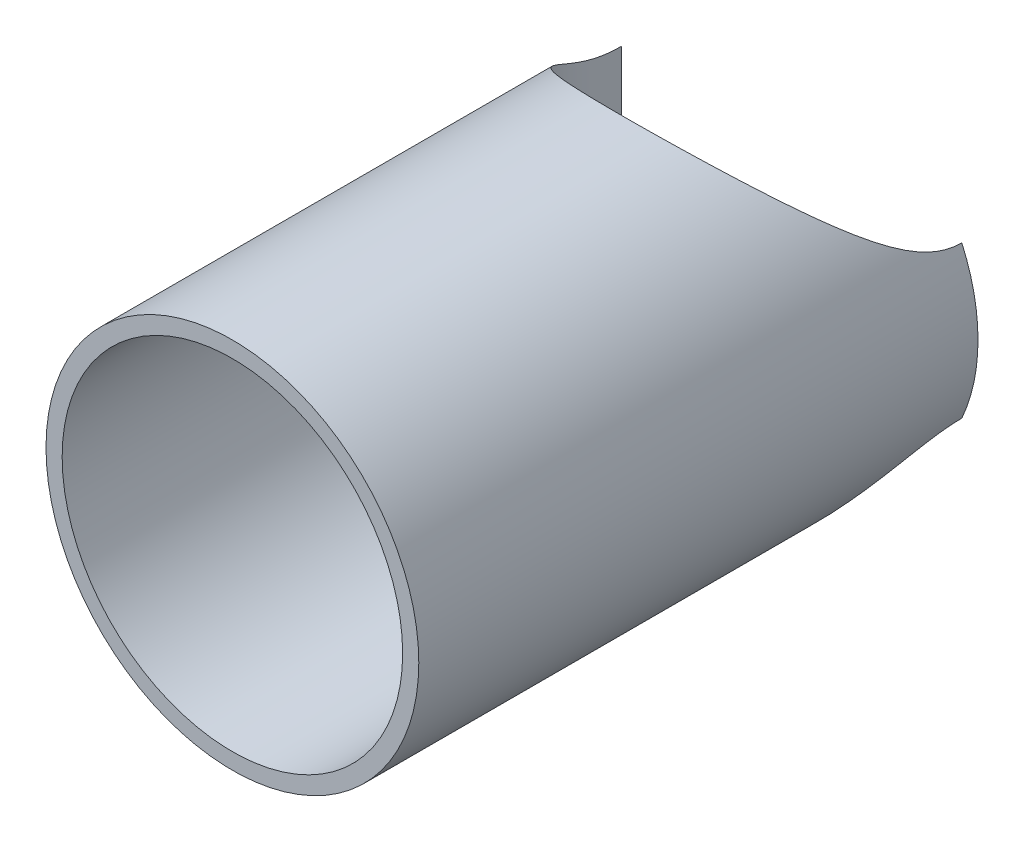
ISO-10303-21;
HEADER;
FILE_DESCRIPTION(('STEP AP214'),'2;1');
FILE_NAME('part.step','',(''),(''),'','','');
FILE_SCHEMA(('AUTOMOTIVE_DESIGN { 1 0 10303 214 1 1 1 1 }'));
ENDSEC;
DATA;
#1=APPLICATION_CONTEXT('core data for automotive mechanical design processes');
#2=APPLICATION_PROTOCOL_DEFINITION('international standard','automotive_design',2000,#1);
#3=PRODUCT_CONTEXT('',#1,'mechanical');
#4=PRODUCT('Part','Part','',(#3));
#5=PRODUCT_RELATED_PRODUCT_CATEGORY('part','',(#4));
#6=PRODUCT_DEFINITION_FORMATION('','',#4);
#7=PRODUCT_DEFINITION_CONTEXT('part definition',#1,'design');
#8=PRODUCT_DEFINITION('design','',#6,#7);
#9=PRODUCT_DEFINITION_SHAPE('','',#8);
#10=(LENGTH_UNIT() NAMED_UNIT(*) SI_UNIT(.MILLI.,.METRE.));
#11=(NAMED_UNIT(*) PLANE_ANGLE_UNIT() SI_UNIT($,.RADIAN.));
#12=(NAMED_UNIT(*) SI_UNIT($,.STERADIAN.) SOLID_ANGLE_UNIT());
#13=UNCERTAINTY_MEASURE_WITH_UNIT(LENGTH_MEASURE(1.E-05),#10,'distance_accuracy_value','');
#14=(GEOMETRIC_REPRESENTATION_CONTEXT(3) GLOBAL_UNCERTAINTY_ASSIGNED_CONTEXT((#13)) GLOBAL_UNIT_ASSIGNED_CONTEXT((#10,
#11,#12)) REPRESENTATION_CONTEXT('',''));
#15=CARTESIAN_POINT('',(0.,0.,0.));
#16=DIRECTION('',(0.,0.,1.));
#17=DIRECTION('',(1.,0.,0.));
#18=AXIS2_PLACEMENT_3D('',#15,#16,#17);
#19=CARTESIAN_POINT('',(0.,0.,0.));
#20=DIRECTION('',(0.,0.,1.));
#21=DIRECTION('',(1.,0.,0.));
#22=AXIS2_PLACEMENT_3D('',#19,#20,#21);
#23=CYLINDRICAL_SURFACE('',#22,17.399);
#24=CARTESIAN_POINT('',(0.,0.,57.15));
#25=DIRECTION('',(0.,0.,1.));
#26=DIRECTION('',(1.,0.,0.));
#27=AXIS2_PLACEMENT_3D('',#24,#25,#26);
#28=CIRCLE('',#27,17.399);
#29=CARTESIAN_POINT('',(17.399,0.,57.15));
#30=VERTEX_POINT('',#29);
#31=EDGE_CURVE('E63',#30,#30,#28,.T.);
#32=ORIENTED_EDGE('',*,*,#31,.T.);
#33=EDGE_LOOP('',(#32));
#34=FACE_BOUND('',#33,.T.);
#35=CARTESIAN_POINT('',(0.,0.,0.));
#36=DIRECTION('',(0.,0.707106781186547,0.707106781186547));
#37=DIRECTION('',(0.,-0.707106781186547,0.707106781186547));
#38=AXIS2_PLACEMENT_3D('',#35,#36,#37);
#39=ELLIPSE('',#38,24.6059017717295,17.399);
#40=CARTESIAN_POINT('',(17.399,0.,0.));
#41=VERTEX_POINT('',#40);
#42=CARTESIAN_POINT('',(-17.399,0.,0.));
#43=VERTEX_POINT('',#42);
#44=EDGE_CURVE('E66',#41,#43,#39,.F.);
#45=ORIENTED_EDGE('',*,*,#44,.T.);
#46=CARTESIAN_POINT('',(-17.399,0.,0.));
#47=CARTESIAN_POINT('',(-17.3990011308637,0.331328994913658,0.331288499369272));
#48=CARTESIAN_POINT('',(-17.3895359806133,0.662777773993524,0.662452537391861));
#49=CARTESIAN_POINT('',(-17.3541828902262,1.28061881246956,1.27984220901783));
#50=CARTESIAN_POINT('',(-17.3306707170862,1.56708522254114,1.56613126731348));
#51=CARTESIAN_POINT('',(-17.2741593932983,2.09467960281504,2.09380128423432));
#52=CARTESIAN_POINT('',(-17.2431973119173,2.33594824844743,2.33526043823023));
#53=CARTESIAN_POINT('',(-17.1776790099059,2.77346193365283,2.77318291899473));
#54=CARTESIAN_POINT('',(-17.1448260231368,2.96984141024758,2.96976916303656));
#55=CARTESIAN_POINT('',(-17.053195396441,3.46498957987095,3.46509972389225));
#56=CARTESIAN_POINT('',(-16.98985851291,3.76343285860517,3.76334049026127));
#57=CARTESIAN_POINT('',(-16.8511806994521,4.34120611378342,4.34086899698307));
#58=CARTESIAN_POINT('',(-16.7767389829828,4.62064871339775,4.62026081720835));
#59=CARTESIAN_POINT('',(-16.618357658026,5.16038592403,5.16002415026488));
#60=CARTESIAN_POINT('',(-16.5352733410015,5.42080962241243,5.42051715790507));
#61=CARTESIAN_POINT('',(-16.3619682824427,5.9225854699662,5.92246621840775));
#62=CARTESIAN_POINT('',(-16.2725596410971,6.16407928160144,6.16406139907093));
#63=CARTESIAN_POINT('',(-16.0648641936773,6.68870400423923,6.68872514664784));
#64=CARTESIAN_POINT('',(-15.9442842191765,6.97140000285117,6.97132558864669));
#65=CARTESIAN_POINT('',(-15.692090264551,7.52138357655295,7.52117234296158));
#66=CARTESIAN_POINT('',(-15.5611400425067,7.7888244237628,7.78856984279287));
#67=CARTESIAN_POINT('',(-15.2898825899193,8.30823658158246,8.30799045094507));
#68=CARTESIAN_POINT('',(-15.1502208515848,8.56037821331848,8.56017986480889));
#69=CARTESIAN_POINT('',(-14.8631475667476,9.04924098266211,9.04916207079481));
#70=CARTESIAN_POINT('',(-14.716363574788,9.28614688008941,9.28613845727461));
#71=CARTESIAN_POINT('',(-14.3951906833458,9.77740171343267,9.77741091638758));
#72=CARTESIAN_POINT('',(-14.2195041976432,10.0313338750929,10.0312781848761));
#73=CARTESIAN_POINT('',(-13.8583245878214,10.524357664459,10.5242054716175));
#74=CARTESIAN_POINT('',(-13.6733966582859,10.7636567269108,10.7634718304358));
#75=CARTESIAN_POINT('',(-13.2950314709039,11.2273598541476,11.2271796122021));
#76=CARTESIAN_POINT('',(-13.1021449124595,11.4519894946947,11.4518441165275));
#77=CARTESIAN_POINT('',(-12.7091177143155,11.8863833716026,11.8863260772742));
#78=CARTESIAN_POINT('',(-12.5095124093792,12.0963898718007,12.0963850678313));
#79=CARTESIAN_POINT('',(-12.0888476825434,12.5170535611354,12.5170585405004));
#80=CARTESIAN_POINT('',(-11.867271036784,12.7274545640097,12.7274132906681));
#81=CARTESIAN_POINT('',(-11.4161369932612,13.1334001596869,13.1332890696922));
#82=CARTESIAN_POINT('',(-11.1870452916996,13.3292035388693,13.3290682211509));
#83=CARTESIAN_POINT('',(-10.7219396261346,13.7059083660326,13.7057759704559));
#84=CARTESIAN_POINT('',(-10.4863707163118,13.8870849012415,13.8869780619076));
#85=CARTESIAN_POINT('',(-10.0093409437893,14.2345561896179,14.2345143840518));
#86=CARTESIAN_POINT('',(-9.76830223262916,14.4011404127409,14.4011376187175));
#87=CARTESIAN_POINT('',(-9.27469282491392,14.7238513521684,14.7238541327518));
#88=CARTESIAN_POINT('',(-9.02218317762893,14.8800245173527,14.8799942085943));
#89=CARTESIAN_POINT('',(-8.51143320550011,15.17780577695,15.1777255632559));
#90=CARTESIAN_POINT('',(-8.25351231100356,15.3196868999698,15.3195894701364));
#91=CARTESIAN_POINT('',(-7.86055793692457,15.522822723787,15.5227259132659));
#92=CARTESIAN_POINT('',(-7.72987393547371,15.5883224924115,15.5882301268393));
#93=CARTESIAN_POINT('',(-7.46744079934224,15.7157097134347,15.7156329083403));
#94=CARTESIAN_POINT('',(-7.33572578439618,15.7776322605029,15.7775664862578));
#95=CARTESIAN_POINT('',(-7.0713408526649,15.89786675948,15.8978253102093));
#96=CARTESIAN_POINT('',(-6.93870294731716,15.9562139212813,15.9561857364243));
#97=CARTESIAN_POINT('',(-6.67257484172981,16.0693059665347,16.0692983003262));
#98=CARTESIAN_POINT('',(-6.5391145696896,16.124086000282,16.1240856593634));
#99=CARTESIAN_POINT('',(-6.27314212663758,16.2293820508048,16.2293823833748));
#100=CARTESIAN_POINT('',(-6.14068677200883,16.2799696359967,16.2799636546496));
#101=CARTESIAN_POINT('',(-5.8748684496391,16.3777589819801,16.3777371159858));
#102=CARTESIAN_POINT('',(-5.74152553126073,16.4249879659121,16.4249565601746));
#103=CARTESIAN_POINT('',(-5.47402115877983,16.5160550971116,16.5160062636609));
#104=CARTESIAN_POINT('',(-5.33987788890363,16.5599199494832,16.5598632139616));
#105=CARTESIAN_POINT('',(-5.0708615482511,16.6442561413558,16.6441886913204));
#106=CARTESIAN_POINT('',(-4.93600480608221,16.6847535344294,16.6846832285512));
#107=CARTESIAN_POINT('',(-4.66564969995905,16.7623545036231,16.762284561608));
#108=CARTESIAN_POINT('',(-4.53016583341798,16.7994833464645,16.7994165741733));
#109=CARTESIAN_POINT('',(-4.25864402464156,16.8703492415508,16.8702936771996));
#110=CARTESIAN_POINT('',(-4.1226187875179,16.9041106384636,16.9040630739031));
#111=CARTESIAN_POINT('',(-3.85010126264908,16.9682459387044,16.9682159832133));
#112=CARTESIAN_POINT('',(-3.7136199403314,16.9986431310521,16.9986227724491));
#113=CARTESIAN_POINT('',(-3.44027598403682,17.0560566629996,17.0560512035975));
#114=CARTESIAN_POINT('',(-3.30342264906392,17.0830951044979,17.0830949768953));
#115=CARTESIAN_POINT('',(-3.03546364409865,17.1326815825355,17.132681703699));
#116=CARTESIAN_POINT('',(-2.90441642762355,17.1553873643714,17.1553829144864));
#117=CARTESIAN_POINT('',(-2.64192370290757,17.1977626436417,17.1977466393632));
#118=CARTESIAN_POINT('',(-2.51048219796085,17.2174445285761,17.2174215511955));
#119=CARTESIAN_POINT('',(-2.24727207444598,17.2537692378582,17.2537335254227));
#120=CARTESIAN_POINT('',(-2.11550651579715,17.2704231484942,17.2703816696755));
#121=CARTESIAN_POINT('',(-1.85171901959868,17.3006908882117,17.3006415630633));
#122=CARTESIAN_POINT('',(-1.71969931056298,17.3143144308917,17.3142630138654));
#123=CARTESIAN_POINT('',(-1.45547409463277,17.3385220761164,17.3384708920411));
#124=CARTESIAN_POINT('',(-1.323270104293,17.3491144575098,17.3490655860987));
#125=CARTESIAN_POINT('',(-1.05874661674972,17.3672620877226,17.36722140925));
#126=CARTESIAN_POINT('',(-0.926428051590948,17.3748241285407,17.3747893222893));
#127=CARTESIAN_POINT('',(-0.661745401360201,17.3869150272733,17.3868930938386));
#128=CARTESIAN_POINT('',(-0.529381797623768,17.3914491490759,17.3914342142522));
#129=CARTESIAN_POINT('',(-0.264678682179303,17.3974897824417,17.3974858865217));
#130=CARTESIAN_POINT('',(-0.13233933998178,17.3989999999915,17.3990001479815));
#131=CARTESIAN_POINT('',(0.132343102844987,17.3990000000085,17.3989998520142));
#132=CARTESIAN_POINT('',(0.264686203474104,17.3974896965932,17.3974852084662));
#133=CARTESIAN_POINT('',(0.529395756251864,17.3914487446318,17.3914329206721));
#134=CARTESIAN_POINT('',(0.661762040001853,17.3869144144388,17.3868915915467));
#135=CARTESIAN_POINT('',(0.92644896772938,17.3748230255675,17.3747874520819));
#136=CARTESIAN_POINT('',(1.0587691326032,17.3672607273787,17.3672194044208));
#137=CARTESIAN_POINT('',(1.32329473756529,17.3491125827395,17.3490633877189));
#138=CARTESIAN_POINT('',(1.4554992489517,17.3385199686424,17.3384686592246));
#139=CARTESIAN_POINT('',(1.71972442920772,17.3143119319016,17.3142607827641));
#140=CARTESIAN_POINT('',(1.85174358595603,17.3006882546736,17.300639392332));
#141=CARTESIAN_POINT('',(2.11552890590344,17.2704203934741,17.270379685527));
#142=CARTESIAN_POINT('',(2.24729284607558,17.2537665200233,17.2537316913085));
#143=CARTESIAN_POINT('',(2.51049867631982,17.2174421050912,17.2174201090593));
#144=CARTESIAN_POINT('',(2.64193751299076,17.1977605012373,17.1977454625961));
#145=CARTESIAN_POINT('',(2.90442384157753,17.1553860801165,17.1553822628499));
#146=CARTESIAN_POINT('',(3.03546733761075,17.1326808990283,17.1326813342488));
#147=CARTESIAN_POINT('',(3.30342657291425,17.0830943783941,17.0830939200179));
#148=CARTESIAN_POINT('',(3.44028379405071,17.0560551202761,17.0560490037316));
#149=CARTESIAN_POINT('',(3.71363437804045,16.9986400001387,16.9986186527062));
#150=CARTESIAN_POINT('',(3.85011845296442,16.9682420615591,16.9682111142236));
#151=CARTESIAN_POINT('',(4.12264033144995,16.904105398461,16.9040569697761));
#152=CARTESIAN_POINT('',(4.25866718163659,16.870343410098,16.8702871133423));
#153=CARTESIAN_POINT('',(4.53019108564152,16.7994765416222,16.7994093825609));
#154=CARTESIAN_POINT('',(4.66567544748057,16.76234734177,16.7622772275004));
#155=CARTESIAN_POINT('',(4.9360304323311,16.6847459483422,16.6846758961775));
#156=CARTESIAN_POINT('',(5.0708865720189,16.6442485126905,16.6441815277317));
#157=CARTESIAN_POINT('',(5.33990061783175,16.55991260583,16.5598566711235));
#158=CARTESIAN_POINT('',(5.47404221030653,16.5160481053818,16.5160001963081));
#159=CARTESIAN_POINT('',(5.74154217437029,16.4249821235549,16.4249517522341));
#160=CARTESIAN_POINT('',(5.87488237757024,16.3777539610281,16.377733114662));
#161=CARTESIAN_POINT('',(6.14069421589947,16.2799667936959,16.2799614823963));
#162=CARTESIAN_POINT('',(6.27314581793012,16.2293805894571,16.2293812542933));
#163=CARTESIAN_POINT('',(6.53911843369672,16.1240844705558,16.1240837889914));
#164=CARTESIAN_POINT('',(6.6725825007365,16.0693028234905,16.0692944809927));
#165=CARTESIAN_POINT('',(6.93871704145251,15.9562078188688,15.956178611685));
#166=CARTESIAN_POINT('',(7.07135760783225,15.8978593336773,15.8978168557831));
#167=CARTESIAN_POINT('',(7.33574670377706,15.7776225505781,15.7775558713312));
#168=CARTESIAN_POINT('',(7.46746324313444,15.7156990653493,15.7156214868573));
#169=CARTESIAN_POINT('',(7.72989830986156,15.5883104113434,15.5882176122188));
#170=CARTESIAN_POINT('',(7.86058273950878,15.5228101701612,15.5227131352272));
#171=CARTESIAN_POINT('',(8.25353521535424,15.3196745134129,15.3195775255319));
#172=CARTESIAN_POINT('',(8.51145389332373,15.177794126177,15.1777148432391));
#173=CARTESIAN_POINT('',(9.02219526517278,14.8800170481196,14.8799876943916));
#174=CARTESIAN_POINT('',(9.27469871505861,14.7238475016823,14.7238507467716));
#175=CARTESIAN_POINT('',(9.76830834571355,14.4011364157789,14.4011331548459));
#176=CARTESIAN_POINT('',(10.0093528614838,14.2345479589407,14.2345052423058));
#177=CARTESIAN_POINT('',(10.4863899241457,13.8870704451552,13.8869626730327));
#178=CARTESIAN_POINT('',(10.7219605410667,13.7058920566566,13.7057591792237));
#179=CARTESIAN_POINT('',(11.1870656131564,13.3291864289314,13.3290515004162));
#180=CARTESIAN_POINT('',(11.4161552377849,13.1333842417648,13.1332739587925));
#181=CARTESIAN_POINT('',(11.8672815432061,12.7274445947568,12.7274041499341));
#182=CARTESIAN_POINT('',(12.088852755031,12.5170484889207,12.517053873492));
#183=CARTESIAN_POINT('',(12.5095175578729,12.0963847230684,12.0963795279133));
#184=CARTESIAN_POINT('',(12.7091276713605,11.8863729021756,11.8863148376935));
#185=CARTESIAN_POINT('',(13.1021607290177,11.4519714571547,11.4518252711373));
#186=CARTESIAN_POINT('',(13.2950485751887,11.2273396628897,11.2271589823143));
#187=CARTESIAN_POINT('',(13.6734130173025,10.7636358783721,10.763451251504));
#188=CARTESIAN_POINT('',(13.858339153512,10.524338411798,10.5241868247927));
#189=CARTESIAN_POINT('',(14.2195124215554,10.031321996054,10.0312669453136));
#190=CARTESIAN_POINT('',(14.3951946051437,9.7773957150844,9.77740523066256));
#191=CARTESIAN_POINT('',(14.7163674472392,9.28614095665167,9.28613224729147));
#192=CARTESIAN_POINT('',(14.8631549792588,9.04922902525791,9.04914954618527));
#193=CARTESIAN_POINT('',(15.1502323847489,8.56035787657117,8.56015891678717));
#194=CARTESIAN_POINT('',(15.2898949291603,8.30821395404564,8.3079674730765));
#195=CARTESIAN_POINT('',(15.5611515555253,7.78880133314123,7.78854689744975));
#196=CARTESIAN_POINT('',(15.6921003797321,7.52136237689545,7.52115152000875));
#197=CARTESIAN_POINT('',(15.944289741381,6.97138706353182,6.97131306349413));
#198=CARTESIAN_POINT('',(16.0648667682493,6.68869750139016,6.68871884448677));
#199=CARTESIAN_POINT('',(16.2725620824778,6.16407311454511,6.16405506139386));
#200=CARTESIAN_POINT('',(16.3619728725739,5.92257307722494,5.92245348547243));
#201=CARTESIAN_POINT('',(16.535280221155,5.42078874277266,5.42049589512133));
#202=CARTESIAN_POINT('',(16.618364872423,5.16036280687721,5.16000079710574));
#203=CARTESIAN_POINT('',(16.7767453827511,4.62062534005807,4.62023748154183));
#204=CARTESIAN_POINT('',(16.8511861632785,4.34118475559803,4.34084779902526));
#205=CARTESIAN_POINT('',(16.9898612578486,3.76341993156685,3.7633277559053));
#206=CARTESIAN_POINT('',(17.053196594646,3.464983105639,3.46509333680204));
#207=CARTESIAN_POINT('',(17.1448268330524,2.96983703330779,2.96976472575839));
#208=CARTESIAN_POINT('',(17.1776804769336,2.77345316738225,2.7731740281345));
#209=CARTESIAN_POINT('',(17.2431993186325,2.33593358655074,2.33524560548374));
#210=CARTESIAN_POINT('',(17.2741613748475,2.09466343246891,2.09378498081143));
#211=CARTESIAN_POINT('',(17.3306721606797,1.567068988297,1.56611497024853));
#212=CARTESIAN_POINT('',(17.3541839563502,1.28060403473809,1.27982739369487));
#213=CARTESIAN_POINT('',(17.3895362343148,0.66276888754068,0.662443645442081));
#214=CARTESIAN_POINT('',(17.3990011304629,0.331324551349306,0.331284053321532));
#215=CARTESIAN_POINT('',(17.399,0.,0.));
#216=B_SPLINE_CURVE_WITH_KNOTS('',3,(#46,#47,#48,#49,#50,#51,#52,#53,#54,#55,#56,#57,#58,#59,
#60,#61,#62,#63,#64,#65,#66,#67,#68,#69,#70,#71,#72,#73,#74,#75,#76,#77,#78,#79,#80,#81,#82,#83,
#84,#85,#86,#87,#88,#89,#90,#91,#92,#93,#94,#95,#96,#97,#98,#99,#100,#101,#102,#103,#104,#105,
#106,#107,#108,#109,#110,#111,#112,#113,#114,#115,#116,#117,#118,#119,#120,#121,#122,#123,#124,
#125,#126,#127,#128,#129,#130,#131,#132,#133,#134,#135,#136,#137,#138,#139,#140,#141,#142,#143,
#144,#145,#146,#147,#148,#149,#150,#151,#152,#153,#154,#155,#156,#157,#158,#159,#160,#161,#162,
#163,#164,#165,#166,#167,#168,#169,#170,#171,#172,#173,#174,#175,#176,#177,#178,#179,#180,#181,
#182,#183,#184,#185,#186,#187,#188,#189,#190,#191,#192,#193,#194,#195,#196,#197,#198,#199,#200,
#201,#202,#203,#204,#205,#206,#207,#208,#209,#210,#211,#212,#213,#214,#215),.UNSPECIFIED.,.F.,
.F.,(4,2,2,2,2,2,2,2,2,2,2,2,2,2,2,2,2,2,2,2,2,2,2,2,2,2,2,2,2,2,2,2,2,2,2,2,2,2,2,2,2,2,2,2,2,
2,2,2,2,2,2,2,2,2,2,2,2,2,2,2,2,2,2,2,2,2,2,2,2,2,2,2,2,2,2,2,2,2,2,2,2,2,2,2,4),(0.,
1.40551630396895,2.62231117885233,3.65037899448081,4.48971758438184,5.76932583809445,
6.9753849332022,8.10794438794428,9.16706431128378,10.4192554462773,11.6195891287589,
12.7682494574323,13.8654466039762,15.0642686263511,16.2207668838282,17.3353827550133,
18.4086093128293,19.521019988392,20.5986721998633,21.6423941807822,22.6530975875911,
23.6589392392227,24.6386430781611,25.1191397415278,25.5935874776259,26.0621612660575,
26.5250427479471,26.9765889886385,27.423915460162,27.867213682969,28.3066804441005,
28.7425177205185,29.1749325751135,29.6041370240872,30.0303478746664,30.4350509025217,
30.8380491089705,31.239540728672,31.6397262351866,32.0388080704063,32.4369903595961,
32.8344786138765,33.23147942219,33.6284915186038,34.0259878478789,34.42417498677,
34.8232584392862,35.2234423286034,35.6249290994545,36.0279192330441,36.4326109763195,
36.8588341719642,37.2880474518629,37.720467610057,38.1563066551372,38.5957716476569,
39.0390645671939,39.486382208024,39.9379161021075,40.4008112215822,40.8693947623903,
41.3438483542563,41.8243469702461,42.8040430011724,43.8098612581141,44.8205903103499,
45.8643208478344,46.9419645023942,48.0543495253715,49.1276035107911,50.2422285290847,
51.3987176391151,52.5975122283296,53.6947376105801,54.8434073531731,56.043731621553,
57.2958945179331,58.3550419584849,59.487610586171,60.6936605083512,61.9732412444898,
62.8125986887249,63.8406727889923,65.0574613794757,66.4629588311663),.UNSPECIFIED.);
#217=EDGE_CURVE('E55',#43,#41,#216,.T.);
#218=ORIENTED_EDGE('',*,*,#217,.T.);
#219=EDGE_LOOP('',(#45,#218));
#220=FACE_BOUND('',#219,.T.);
#221=ADVANCED_FACE('F16',(#34,#220),#23,.F.);
#222=CARTESIAN_POINT('',(0.,0.,57.15));
#223=DIRECTION('',(0.,0.,-1.));
#224=DIRECTION('',(-1.,0.,0.));
#225=AXIS2_PLACEMENT_3D('',#222,#223,#224);
#226=PLANE('',#225);
#227=ORIENTED_EDGE('',*,*,#31,.F.);
#228=EDGE_LOOP('',(#227));
#229=FACE_BOUND('',#228,.T.);
#230=CARTESIAN_POINT('',(0.,0.,57.15));
#231=DIRECTION('',(0.,0.,1.));
#232=DIRECTION('',(1.,0.,0.));
#233=AXIS2_PLACEMENT_3D('',#230,#231,#232);
#234=CIRCLE('',#233,19.05);
#235=CARTESIAN_POINT('',(19.05,0.,57.15));
#236=VERTEX_POINT('',#235);
#237=EDGE_CURVE('E86',#236,#236,#234,.F.);
#238=ORIENTED_EDGE('',*,*,#237,.F.);
#239=EDGE_LOOP('',(#238));
#240=FACE_BOUND('',#239,.T.);
#241=ADVANCED_FACE('F124',(#229,#240),#226,.F.);
#242=CARTESIAN_POINT('',(0.,0.,0.));
#243=DIRECTION('',(0.,1.,0.));
#244=DIRECTION('',(0.,0.,1.));
#245=AXIS2_PLACEMENT_3D('',#242,#243,#244);
#246=CYLINDRICAL_SURFACE('',#245,17.399);
#247=ORIENTED_EDGE('',*,*,#217,.F.);
#248=DIRECTION('',(0.,1.,0.));
#249=VECTOR('',#248,1.);
#250=CARTESIAN_POINT('',(-17.399,0.,0.));
#251=LINE('',#250,#249);
#252=CARTESIAN_POINT('',(-17.399,7.75740285147033,0.));
#253=VERTEX_POINT('',#252);
#254=EDGE_CURVE('E60',#253,#43,#251,.F.);
#255=ORIENTED_EDGE('',*,*,#254,.F.);
#256=CARTESIAN_POINT('',(17.399,7.75740285147032,0.));
#257=CARTESIAN_POINT('',(17.3990027926557,7.75738928067626,0.126619411653411));
#258=CARTESIAN_POINT('',(17.3976172953479,7.76050481767002,0.25321342214225));
#259=CARTESIAN_POINT('',(17.3920993093259,7.7728663106787,0.506011561056936));
#260=CARTESIAN_POINT('',(17.3879674951789,7.78211076127069,0.632215777580589));
#261=CARTESIAN_POINT('',(17.3715310393773,7.81876986710136,1.00902330778525));
#262=CARTESIAN_POINT('',(17.3551849725285,7.85511193712096,1.25863541656879));
#263=CARTESIAN_POINT('',(17.3126787054344,7.94834436267528,1.74803233786395));
#264=CARTESIAN_POINT('',(17.2867118539878,8.00482912325347,1.98791378893045));
#265=CARTESIAN_POINT('',(17.2256220476168,8.13545614886296,2.46176178605719));
#266=CARTESIAN_POINT('',(17.1904915826852,8.20961289257842,2.69572330712606));
#267=CARTESIAN_POINT('',(17.0914704002142,8.41444164911149,3.27608545997221));
#268=CARTESIAN_POINT('',(17.0220928683165,8.55453145327276,3.6182148201961));
#269=CARTESIAN_POINT('',(16.8659507450822,8.85840913920196,4.2875618159471));
#270=CARTESIAN_POINT('',(16.7791763237468,9.02221040436538,4.6147708919803));
#271=CARTESIAN_POINT('',(16.5885907607409,9.36806215757178,5.25908025866418));
#272=CARTESIAN_POINT('',(16.4846028375362,9.55029344833314,5.57602990071133));
#273=CARTESIAN_POINT('',(16.2611162606568,9.92604811707565,6.19761374754541));
#274=CARTESIAN_POINT('',(16.1416117153161,10.1195757688457,6.50224321644266));
#275=CARTESIAN_POINT('',(15.9012328343761,10.4927199440383,7.0682446326165));
#276=CARTESIAN_POINT('',(15.7818795075659,10.6716028930283,7.33075234639334));
#277=CARTESIAN_POINT('',(15.531375280231,11.0330066315397,7.84755054304734));
#278=CARTESIAN_POINT('',(15.4002228366692,11.2155278944272,8.10183994524194));
#279=CARTESIAN_POINT('',(15.1261173325553,11.5825543909568,8.60275103720113));
#280=CARTESIAN_POINT('',(14.9831580377589,11.7670606274058,8.84936858024162));
#281=CARTESIAN_POINT('',(14.6854749405307,12.1365419716062,9.33504840785215));
#282=CARTESIAN_POINT('',(14.5307500246226,12.3215171221294,9.57410997430043));
#283=CARTESIAN_POINT('',(14.0499414824725,12.873976753931,10.2784757466186));
#284=CARTESIAN_POINT('',(13.706221982577,13.2403569500405,10.7327911450247));
#285=CARTESIAN_POINT('',(12.9709988366539,13.9614056628348,11.6105902831832));
#286=CARTESIAN_POINT('',(12.5795204493307,14.3160802453506,12.0340901330639));
#287=CARTESIAN_POINT('',(11.8513027830295,14.9202493412787,12.7460780346227));
#288=CARTESIAN_POINT('',(11.5252152004648,15.17393857843,13.0419213680792));
#289=CARTESIAN_POINT('',(10.8451357651757,15.6672254345686,13.6126880208168));
#290=CARTESIAN_POINT('',(10.4911442114866,15.9068232045201,13.8876115642246));
#291=CARTESIAN_POINT('',(9.75564643242529,16.3682053590736,14.4137713143204));
#292=CARTESIAN_POINT('',(9.37416774185506,16.5900071123435,14.6650306596365));
#293=CARTESIAN_POINT('',(8.58390774378863,17.0123369264844,15.1411487148883));
#294=CARTESIAN_POINT('',(8.17513251731962,17.2128696999897,15.3660132743823));
#295=CARTESIAN_POINT('',(7.41609675759785,17.5510787980119,15.7438449488538));
#296=CARTESIAN_POINT('',(7.07052907343836,17.6932976749746,15.9021892450144));
#297=CARTESIAN_POINT('',(6.36382451687043,17.9595864108884,16.1979501260028));
#298=CARTESIAN_POINT('',(6.00269106933712,18.0836602360993,16.3353712846128));
#299=CARTESIAN_POINT('',(5.26647789377182,18.3116118596446,16.5873660705376));
#300=CARTESIAN_POINT('',(4.89140366751785,18.4154975265765,16.7019485999545));
#301=CARTESIAN_POINT('',(4.12923028647434,18.6012306252741,16.9065171053999));
#302=CARTESIAN_POINT('',(3.74213100127713,18.6830778179467,16.9965028145804));
#303=CARTESIAN_POINT('',(2.95593537190506,18.8235337773239,17.1507769807365));
#304=CARTESIAN_POINT('',(2.55677683000922,18.8819860313285,17.2148923872178));
#305=CARTESIAN_POINT('',(1.75207798329656,18.9735785556383,17.3153056168189));
#306=CARTESIAN_POINT('',(1.34653766138734,19.0067187581382,17.3516033654214));
#307=CARTESIAN_POINT('',(0.532740871466215,19.0469054092445,17.3956140232931));
#308=CARTESIAN_POINT('',(0.124485289769621,19.0539599906146,17.4033358417348));
#309=CARTESIAN_POINT('',(-0.691145635542919,19.0418258138202,17.3900500247943));
#310=CARTESIAN_POINT('',(-1.09852104488593,19.02263908821,17.3690446145166));
#311=CARTESIAN_POINT('',(-1.8665074066449,18.9618364386318,17.3024305274246));
#312=CARTESIAN_POINT('',(-2.22756908470296,18.9227652631555,17.2596128163397));
#313=CARTESIAN_POINT('',(-2.94361664813323,18.8246695916722,17.1520079260685));
#314=CARTESIAN_POINT('',(-3.29860304440391,18.7656467822389,17.0872226038712));
#315=CARTESIAN_POINT('',(-4.0003834177903,18.6286682489913,16.9366748894927));
#316=CARTESIAN_POINT('',(-4.34717668373009,18.5507108882069,16.8509106835957));
#317=CARTESIAN_POINT('',(-5.03073264287061,18.3771216594109,16.65961931318));
#318=CARTESIAN_POINT('',(-5.36749474073485,18.2814887447958,16.5540909783843));
#319=CARTESIAN_POINT('',(-6.0450883689476,18.0690712727941,16.319211609248));
#320=CARTESIAN_POINT('',(-6.38536566225004,17.9515031398445,16.1889732182396));
#321=CARTESIAN_POINT('',(-7.05200979717746,17.7002421296737,15.9099012910429));
#322=CARTESIAN_POINT('',(-7.37837661185776,17.5665492212207,15.7610677188377));
#323=CARTESIAN_POINT('',(-8.01637955747606,17.2847274052077,15.4463398391999));
#324=CARTESIAN_POINT('',(-8.328012631591,17.1365955213283,15.2804420139058));
#325=CARTESIAN_POINT('',(-8.935938653738,16.8275912941987,14.9330779736276));
#326=CARTESIAN_POINT('',(-9.23222831724048,16.6667162415391,14.751608447154));
#327=CARTESIAN_POINT('',(-9.9610807011477,16.24616265681,14.2751141336036));
#328=CARTESIAN_POINT('',(-10.3832304302347,15.9790705087056,13.9706188807904));
#329=CARTESIAN_POINT('',(-11.1906483352997,15.4243967388524,13.3326512383542));
#330=CARTESIAN_POINT('',(-11.5758996118658,15.1368058328948,12.9991657033674));
#331=CARTESIAN_POINT('',(-12.3107246973626,14.5454983316236,12.3055766392129));
#332=CARTESIAN_POINT('',(-12.6601983724747,14.2417399093146,11.9454030182208));
#333=CARTESIAN_POINT('',(-13.3228256699069,13.6238744147983,11.2015895641249));
#334=CARTESIAN_POINT('',(-13.6359864105728,13.3097693863682,10.8179543527437));
#335=CARTESIAN_POINT('',(-14.2338486111263,12.6687294700676,10.0188698517803));
#336=CARTESIAN_POINT('',(-14.517686463156,12.3416676006416,9.60287793519721));
#337=CARTESIAN_POINT('',(-15.0487827113267,11.688186754623,8.74718214020965));
#338=CARTESIAN_POINT('',(-15.2960234328361,11.3617681633013,8.30746694358541));
#339=CARTESIAN_POINT('',(-15.6391176739874,10.8793160856903,7.62936065904868));
#340=CARTESIAN_POINT('',(-15.7488029782036,10.719778727444,7.40036468575159));
#341=CARTESIAN_POINT('',(-15.9589029321097,10.4044108647402,6.93568044188579));
#342=CARTESIAN_POINT('',(-16.0593187405627,10.2485798987662,6.69999301263361));
#343=CARTESIAN_POINT('',(-16.25064002581,9.94242216980458,6.22159236078593));
#344=CARTESIAN_POINT('',(-16.3415534376162,9.79209088359618,5.9788852198135));
#345=CARTESIAN_POINT('',(-16.5136633013956,9.49896230357114,5.48564865833395));
#346=CARTESIAN_POINT('',(-16.5948621460068,9.35616315949889,5.23512118317326));
#347=CARTESIAN_POINT('',(-16.7399044598348,9.0938654480011,4.74960595279279));
#348=CARTESIAN_POINT('',(-16.8046633839798,8.97344114073015,4.51539494834857));
#349=CARTESIAN_POINT('',(-16.9253972886873,8.74358476749362,4.03935876063696));
#350=CARTESIAN_POINT('',(-16.981371807116,8.63415327995198,3.79753317758154));
#351=CARTESIAN_POINT('',(-17.0835577011958,8.43015385639926,3.30749209621929));
#352=CARTESIAN_POINT('',(-17.1298288043977,8.33549596631582,3.05932691299979));
#353=CARTESIAN_POINT('',(-17.2122316312634,8.16398538994439,2.5552691644349));
#354=CARTESIAN_POINT('',(-17.2483680118588,8.08712452871587,2.29938020825192));
#355=CARTESIAN_POINT('',(-17.2984619179858,7.97921413520514,1.87510757973661));
#356=CARTESIAN_POINT('',(-17.3157056836072,7.94167042397934,1.70875077851932));
#357=CARTESIAN_POINT('',(-17.3454986249528,7.87638621901043,1.37373521286451));
#358=CARTESIAN_POINT('',(-17.35804919276,7.84864281846194,1.20507714643116));
#359=CARTESIAN_POINT('',(-17.3783689967595,7.80355358549084,0.864236195915917));
#360=CARTESIAN_POINT('',(-17.386085725966,7.78632198711612,0.692034904492624));
#361=CARTESIAN_POINT('',(-17.3964114605965,7.76320820627028,0.346566926126348));
#362=CARTESIAN_POINT('',(-17.3990157927525,7.75733640792047,0.173299409508219));
#363=CARTESIAN_POINT('',(-17.399,7.75740285147036,0.));
#364=B_SPLINE_CURVE_WITH_KNOTS('',3,(#256,#257,#258,#259,#260,#261,#262,#263,#264,#265,#266,
#267,#268,#269,#270,#271,#272,#273,#274,#275,#276,#277,#278,#279,#280,#281,#282,#283,#284,#285,
#286,#287,#288,#289,#290,#291,#292,#293,#294,#295,#296,#297,#298,#299,#300,#301,#302,#303,#304,
#305,#306,#307,#308,#309,#310,#311,#312,#313,#314,#315,#316,#317,#318,#319,#320,#321,#322,#323,
#324,#325,#326,#327,#328,#329,#330,#331,#332,#333,#334,#335,#336,#337,#338,#339,#340,#341,#342,
#343,#344,#345,#346,#347,#348,#349,#350,#351,#352,#353,#354,#355,#356,#357,#358,#359,#360,#361,
#362,#363),.UNSPECIFIED.,.F.,.F.,(4,2,2,2,2,2,2,2,2,2,2,2,2,2,2,2,2,2,2,2,2,2,2,2,2,2,2,2,2,2,2,
2,2,2,2,2,2,2,2,2,2,2,2,2,2,2,2,2,2,2,2,2,2,4),(0.,0.379764092853832,0.759434940165907,
1.51634726991587,2.25880724087371,3.00187761458815,4.12835037763911,5.25546144985719,
6.39496160348711,7.53489569789875,8.55259337985784,9.57042434587642,10.5887962249633,
11.6072646010801,13.6367495933949,15.6651658480776,17.1883664070907,18.71155064481,
20.2332297195439,21.754570923617,22.9709961355442,24.187155054878,25.4028390055058,
26.6185361444175,27.8422355786928,29.0659382909752,30.2892594549617,31.5124858703965,
32.6082843336791,33.7039901888642,34.7997908060849,35.8956563285599,37.043090764153,
38.1905274222329,39.3382011047018,40.4861194600479,42.2386035757021,43.991886525206,
45.749949583538,47.5076674278728,49.3075787665061,51.1083565581975,52.0077767250255,
52.9070843042517,53.8056348105302,54.7039635517725,55.5171752742101,56.3304297641097,
57.1385211097759,57.9462405247014,58.4601584642904,58.9739238458356,59.4931773421598,
60.0129052701035),.UNSPECIFIED.);
#365=CARTESIAN_POINT('',(17.399,7.75740285147032,0.));
#366=VERTEX_POINT('',#365);
#367=EDGE_CURVE('E49',#366,#253,#364,.T.);
#368=ORIENTED_EDGE('',*,*,#367,.F.);
#369=DIRECTION('',(0.,1.,0.));
#370=VECTOR('',#369,1.);
#371=CARTESIAN_POINT('',(17.399,0.,0.));
#372=LINE('',#371,#370);
#373=EDGE_CURVE('E62',#41,#366,#372,.T.);
#374=ORIENTED_EDGE('',*,*,#373,.F.);
#375=EDGE_LOOP('',(#247,#255,#368,#374));
#376=FACE_BOUND('',#375,.T.);
#377=ADVANCED_FACE('F58',(#376),#246,.F.);
#378=CARTESIAN_POINT('',(0.,0.,0.));
#379=DIRECTION('',(0.,0.,-1.));
#380=DIRECTION('',(-1.,0.,0.));
#381=AXIS2_PLACEMENT_3D('',#378,#379,#380);
#382=PLANE('',#381);
#383=DIRECTION('',(0.,1.,0.));
#384=VECTOR('',#383,1.);
#385=CARTESIAN_POINT('',(-17.399,0.,0.));
#386=LINE('',#385,#384);
#387=CARTESIAN_POINT('',(-17.399,-7.75740285147033,0.));
#388=VERTEX_POINT('',#387);
#389=EDGE_CURVE('E68',#43,#388,#386,.F.);
#390=ORIENTED_EDGE('',*,*,#389,.T.);
#391=CARTESIAN_POINT('',(0.,0.,0.));
#392=DIRECTION('',(0.,0.,1.));
#393=DIRECTION('',(1.,0.,0.));
#394=AXIS2_PLACEMENT_3D('',#391,#392,#393);
#395=CIRCLE('',#394,19.05);
#396=EDGE_CURVE('E72',#253,#388,#395,.T.);
#397=ORIENTED_EDGE('',*,*,#396,.F.);
#398=ORIENTED_EDGE('',*,*,#254,.T.);
#399=EDGE_LOOP('',(#390,#397,#398));
#400=FACE_BOUND('',#399,.T.);
#401=ADVANCED_FACE('F70',(#400),#382,.T.);
#402=CARTESIAN_POINT('',(0.,0.,0.));
#403=DIRECTION('',(0.,1.,0.));
#404=DIRECTION('',(0.,0.,1.));
#405=AXIS2_PLACEMENT_3D('',#402,#403,#404);
#406=CYLINDRICAL_SURFACE('',#405,17.399);
#407=ORIENTED_EDGE('',*,*,#389,.F.);
#408=ORIENTED_EDGE('',*,*,#44,.F.);
#409=DIRECTION('',(0.,1.,0.));
#410=VECTOR('',#409,1.);
#411=CARTESIAN_POINT('',(17.399,0.,0.));
#412=LINE('',#411,#410);
#413=CARTESIAN_POINT('',(17.399,-7.75740285147033,0.));
#414=VERTEX_POINT('',#413);
#415=EDGE_CURVE('E35',#414,#41,#412,.T.);
#416=ORIENTED_EDGE('',*,*,#415,.F.);
#417=CARTESIAN_POINT('',(-17.399,-7.75740285147033,0.));
#418=CARTESIAN_POINT('',(-17.3990027926557,-7.75738928067626,0.12661941165341));
#419=CARTESIAN_POINT('',(-17.3976172953479,-7.76050481767003,0.253213422142249));
#420=CARTESIAN_POINT('',(-17.3920993093259,-7.77286631067871,0.506011561056935));
#421=CARTESIAN_POINT('',(-17.3879674951789,-7.78211076127069,0.632215777580588));
#422=CARTESIAN_POINT('',(-17.3715310393773,-7.81876986710136,1.00902330778525));
#423=CARTESIAN_POINT('',(-17.3551849725285,-7.85511193712095,1.25863541656879));
#424=CARTESIAN_POINT('',(-17.3126787054344,-7.94834436267528,1.74803233786395));
#425=CARTESIAN_POINT('',(-17.2867118539878,-8.00482912325347,1.98791378893045));
#426=CARTESIAN_POINT('',(-17.2256220476168,-8.13545614886296,2.46176178605719));
#427=CARTESIAN_POINT('',(-17.1904915826852,-8.20961289257843,2.69572330712606));
#428=CARTESIAN_POINT('',(-17.0914704002142,-8.4144416491115,3.27608545997221));
#429=CARTESIAN_POINT('',(-17.0220928683165,-8.55453145327277,3.6182148201961));
#430=CARTESIAN_POINT('',(-16.8659507450822,-8.85840913920196,4.2875618159471));
#431=CARTESIAN_POINT('',(-16.7791763237468,-9.02221040436538,4.6147708919803));
#432=CARTESIAN_POINT('',(-16.5885907607409,-9.36806215757178,5.25908025866417));
#433=CARTESIAN_POINT('',(-16.4846028375362,-9.55029344833314,5.57602990071133));
#434=CARTESIAN_POINT('',(-16.2611162606568,-9.92604811707565,6.19761374754541));
#435=CARTESIAN_POINT('',(-16.1416117153161,-10.1195757688457,6.50224321644265));
#436=CARTESIAN_POINT('',(-15.9012328343761,-10.4927199440383,7.06824463261649));
#437=CARTESIAN_POINT('',(-15.7818795075659,-10.6716028930283,7.33075234639333));
#438=CARTESIAN_POINT('',(-15.531375280231,-11.0330066315397,7.84755054304734));
#439=CARTESIAN_POINT('',(-15.4002228366692,-11.2155278944272,8.10183994524194));
#440=CARTESIAN_POINT('',(-15.1261173325553,-11.5825543909568,8.60275103720113));
#441=CARTESIAN_POINT('',(-14.9831580377589,-11.7670606274058,8.84936858024161));
#442=CARTESIAN_POINT('',(-14.6854749405307,-12.1365419716061,9.33504840785214));
#443=CARTESIAN_POINT('',(-14.5307500246226,-12.3215171221294,9.57410997430043));
#444=CARTESIAN_POINT('',(-14.0499414824725,-12.873976753931,10.2784757466186));
#445=CARTESIAN_POINT('',(-13.706221982577,-13.2403569500405,10.7327911450247));
#446=CARTESIAN_POINT('',(-12.9709988366539,-13.9614056628348,11.6105902831832));
#447=CARTESIAN_POINT('',(-12.5795204493307,-14.3160802453506,12.0340901330639));
#448=CARTESIAN_POINT('',(-11.8513027830295,-14.9202493412786,12.7460780346226));
#449=CARTESIAN_POINT('',(-11.5252152004648,-15.17393857843,13.0419213680792));
#450=CARTESIAN_POINT('',(-10.8451357651757,-15.6672254345686,13.6126880208168));
#451=CARTESIAN_POINT('',(-10.4911442114866,-15.9068232045201,13.8876115642246));
#452=CARTESIAN_POINT('',(-9.7556464324253,-16.3682053590736,14.4137713143204));
#453=CARTESIAN_POINT('',(-9.37416774185507,-16.5900071123435,14.6650306596365));
#454=CARTESIAN_POINT('',(-8.58390774378864,-17.0123369264844,15.1411487148883));
#455=CARTESIAN_POINT('',(-8.17513251731962,-17.2128696999896,15.3660132743823));
#456=CARTESIAN_POINT('',(-7.41609675759786,-17.5510787980119,15.7438449488538));
#457=CARTESIAN_POINT('',(-7.07052907343837,-17.6932976749746,15.9021892450143));
#458=CARTESIAN_POINT('',(-6.36382451687044,-17.9595864108884,16.1979501260028));
#459=CARTESIAN_POINT('',(-6.00269106933713,-18.0836602360993,16.3353712846128));
#460=CARTESIAN_POINT('',(-5.26647789377183,-18.3116118596446,16.5873660705375));
#461=CARTESIAN_POINT('',(-4.89140366751786,-18.4154975265765,16.7019485999545));
#462=CARTESIAN_POINT('',(-4.12923028647435,-18.6012306252741,16.9065171053999));
#463=CARTESIAN_POINT('',(-3.74213100127715,-18.6830778179467,16.9965028145804));
#464=CARTESIAN_POINT('',(-2.95593537190507,-18.8235337773239,17.1507769807365));
#465=CARTESIAN_POINT('',(-2.55677683000923,-18.8819860313285,17.2148923872178));
#466=CARTESIAN_POINT('',(-1.75207798329657,-18.9735785556383,17.3153056168189));
#467=CARTESIAN_POINT('',(-1.34653766138736,-19.0067187581382,17.3516033654214));
#468=CARTESIAN_POINT('',(-0.53274087146623,-19.0469054092445,17.3956140232931));
#469=CARTESIAN_POINT('',(-0.124485289769636,-19.0539599906146,17.4033358417348));
#470=CARTESIAN_POINT('',(0.691145635542903,-19.0418258138202,17.3900500247943));
#471=CARTESIAN_POINT('',(1.09852104488592,-19.02263908821,17.3690446145166));
#472=CARTESIAN_POINT('',(1.86650740664488,-18.9618364386318,17.3024305274246));
#473=CARTESIAN_POINT('',(2.22756908470294,-18.9227652631555,17.2596128163397));
#474=CARTESIAN_POINT('',(2.94361664813322,-18.8246695916722,17.1520079260685));
#475=CARTESIAN_POINT('',(3.2986030444039,-18.7656467822389,17.0872226038712));
#476=CARTESIAN_POINT('',(4.00038341779028,-18.6286682489913,16.9366748894927));
#477=CARTESIAN_POINT('',(4.34717668373008,-18.5507108882069,16.8509106835957));
#478=CARTESIAN_POINT('',(5.0307326428706,-18.3771216594109,16.65961931318));
#479=CARTESIAN_POINT('',(5.36749474073483,-18.2814887447958,16.5540909783843));
#480=CARTESIAN_POINT('',(6.04508836894759,-18.0690712727941,16.319211609248));
#481=CARTESIAN_POINT('',(6.38536566225002,-17.9515031398445,16.1889732182397));
#482=CARTESIAN_POINT('',(7.05200979717744,-17.7002421296737,15.9099012910429));
#483=CARTESIAN_POINT('',(7.37837661185775,-17.5665492212207,15.7610677188377));
#484=CARTESIAN_POINT('',(8.01637955747604,-17.2847274052077,15.4463398391999));
#485=CARTESIAN_POINT('',(8.32801263159099,-17.1365955213283,15.2804420139058));
#486=CARTESIAN_POINT('',(8.93593865373799,-16.8275912941988,14.9330779736276));
#487=CARTESIAN_POINT('',(9.23222831724047,-16.6667162415391,14.751608447154));
#488=CARTESIAN_POINT('',(9.96108070114769,-16.24616265681,14.2751141336036));
#489=CARTESIAN_POINT('',(10.3832304302346,-15.9790705087056,13.9706188807904));
#490=CARTESIAN_POINT('',(11.1906483352997,-15.4243967388524,13.3326512383542));
#491=CARTESIAN_POINT('',(11.5758996118658,-15.1368058328948,12.9991657033674));
#492=CARTESIAN_POINT('',(12.3107246973626,-14.5454983316236,12.3055766392129));
#493=CARTESIAN_POINT('',(12.6601983724747,-14.2417399093146,11.9454030182208));
#494=CARTESIAN_POINT('',(13.3228256699068,-13.6238744147983,11.2015895641249));
#495=CARTESIAN_POINT('',(13.6359864105728,-13.3097693863682,10.8179543527437));
#496=CARTESIAN_POINT('',(14.2338486111263,-12.6687294700676,10.0188698517803));
#497=CARTESIAN_POINT('',(14.517686463156,-12.3416676006417,9.60287793519723));
#498=CARTESIAN_POINT('',(15.0487827113267,-11.688186754623,8.74718214020967));
#499=CARTESIAN_POINT('',(15.296023432836,-11.3617681633013,8.30746694358543));
#500=CARTESIAN_POINT('',(15.6391176739874,-10.8793160856903,7.6293606590487));
#501=CARTESIAN_POINT('',(15.7488029782035,-10.719778727444,7.40036468575161));
#502=CARTESIAN_POINT('',(15.9589029321096,-10.4044108647403,6.93568044188581));
#503=CARTESIAN_POINT('',(16.0593187405627,-10.2485798987662,6.69999301263363));
#504=CARTESIAN_POINT('',(16.25064002581,-9.9424221698046,6.22159236078595));
#505=CARTESIAN_POINT('',(16.3415534376162,-9.79209088359619,5.97888521981352));
#506=CARTESIAN_POINT('',(16.5136633013956,-9.49896230357115,5.48564865833397));
#507=CARTESIAN_POINT('',(16.5948621460068,-9.35616315949891,5.23512118317328));
#508=CARTESIAN_POINT('',(16.7399044598348,-9.09386544800111,4.74960595279281));
#509=CARTESIAN_POINT('',(16.8046633839798,-8.97344114073016,4.51539494834859));
#510=CARTESIAN_POINT('',(16.9253972886873,-8.74358476749363,4.03935876063698));
#511=CARTESIAN_POINT('',(16.981371807116,-8.63415327995198,3.79753317758156));
#512=CARTESIAN_POINT('',(17.0835577011958,-8.43015385639927,3.30749209621931));
#513=CARTESIAN_POINT('',(17.1298288043977,-8.33549596631583,3.05932691299981));
#514=CARTESIAN_POINT('',(17.2122316312634,-8.1639853899444,2.55526916443491));
#515=CARTESIAN_POINT('',(17.2483680118588,-8.08712452871588,2.29938020825194));
#516=CARTESIAN_POINT('',(17.2984619179858,-7.97921413520514,1.87510757973663));
#517=CARTESIAN_POINT('',(17.3157056836072,-7.94167042397934,1.70875077851933));
#518=CARTESIAN_POINT('',(17.3454986249528,-7.87638621901043,1.37373521286452));
#519=CARTESIAN_POINT('',(17.35804919276,-7.84864281846194,1.20507714643117));
#520=CARTESIAN_POINT('',(17.3783689967595,-7.80355358549084,0.864236195915927));
#521=CARTESIAN_POINT('',(17.386085725966,-7.78632198711612,0.692034904492632));
#522=CARTESIAN_POINT('',(17.3964114605965,-7.76320820627028,0.346566926126351));
#523=CARTESIAN_POINT('',(17.3990157927525,-7.75733640792047,0.173299409508221));
#524=CARTESIAN_POINT('',(17.399,-7.75740285147035,0.));
#525=B_SPLINE_CURVE_WITH_KNOTS('',3,(#417,#418,#419,#420,#421,#422,#423,#424,#425,#426,#427,
#428,#429,#430,#431,#432,#433,#434,#435,#436,#437,#438,#439,#440,#441,#442,#443,#444,#445,#446,
#447,#448,#449,#450,#451,#452,#453,#454,#455,#456,#457,#458,#459,#460,#461,#462,#463,#464,#465,
#466,#467,#468,#469,#470,#471,#472,#473,#474,#475,#476,#477,#478,#479,#480,#481,#482,#483,#484,
#485,#486,#487,#488,#489,#490,#491,#492,#493,#494,#495,#496,#497,#498,#499,#500,#501,#502,#503,
#504,#505,#506,#507,#508,#509,#510,#511,#512,#513,#514,#515,#516,#517,#518,#519,#520,#521,#522,
#523,#524),.UNSPECIFIED.,.F.,.F.,(4,2,2,2,2,2,2,2,2,2,2,2,2,2,2,2,2,2,2,2,2,2,2,2,2,2,2,2,2,2,2,
2,2,2,2,2,2,2,2,2,2,2,2,2,2,2,2,2,2,2,2,2,2,4),(0.,0.379764092853832,0.759434940165909,
1.51634726991587,2.25880724087371,3.00187761458815,4.12835037763911,5.25546144985719,
6.39496160348711,7.53489569789875,8.55259337985784,9.57042434587641,10.5887962249633,
11.6072646010801,13.6367495933949,15.6651658480776,17.1883664070907,18.71155064481,
20.2332297195439,21.754570923617,22.9709961355442,24.187155054878,25.4028390055058,
26.6185361444175,27.8422355786928,29.0659382909752,30.2892594549617,31.5124858703965,
32.608284333679,33.7039901888642,34.7997908060849,35.8956563285599,37.043090764153,
38.1905274222329,39.3382011047017,40.4861194600479,42.2386035757021,43.991886525206,
45.749949583538,47.5076674278728,49.3075787665061,51.1083565581975,52.0077767250255,
52.9070843042517,53.8056348105302,54.7039635517725,55.5171752742101,56.3304297641096,
57.1385211097759,57.9462405247014,58.4601584642904,58.9739238458356,59.4931773421598,
60.0129052701035),.UNSPECIFIED.);
#526=EDGE_CURVE('E26',#388,#414,#525,.T.);
#527=ORIENTED_EDGE('',*,*,#526,.F.);
#528=EDGE_LOOP('',(#407,#408,#416,#527));
#529=FACE_BOUND('',#528,.T.);
#530=ADVANCED_FACE('F74',(#529),#406,.F.);
#531=CARTESIAN_POINT('',(0.,0.,0.));
#532=DIRECTION('',(0.,0.,-1.));
#533=DIRECTION('',(-1.,0.,0.));
#534=AXIS2_PLACEMENT_3D('',#531,#532,#533);
#535=PLANE('',#534);
#536=CARTESIAN_POINT('',(0.,0.,0.));
#537=DIRECTION('',(0.,0.,1.));
#538=DIRECTION('',(1.,0.,0.));
#539=AXIS2_PLACEMENT_3D('',#536,#537,#538);
#540=CIRCLE('',#539,19.05);
#541=EDGE_CURVE('E11',#414,#366,#540,.T.);
#542=ORIENTED_EDGE('',*,*,#541,.F.);
#543=ORIENTED_EDGE('',*,*,#415,.T.);
#544=ORIENTED_EDGE('',*,*,#373,.T.);
#545=EDGE_LOOP('',(#542,#543,#544));
#546=FACE_BOUND('',#545,.T.);
#547=ADVANCED_FACE('F107',(#546),#535,.T.);
#548=CARTESIAN_POINT('',(0.,0.,0.));
#549=DIRECTION('',(0.,0.,1.));
#550=DIRECTION('',(1.,0.,0.));
#551=AXIS2_PLACEMENT_3D('',#548,#549,#550);
#552=CYLINDRICAL_SURFACE('',#551,19.05);
#553=ORIENTED_EDGE('',*,*,#526,.T.);
#554=ORIENTED_EDGE('',*,*,#541,.T.);
#555=ORIENTED_EDGE('',*,*,#367,.T.);
#556=ORIENTED_EDGE('',*,*,#396,.T.);
#557=EDGE_LOOP('',(#553,#554,#555,#556));
#558=FACE_BOUND('',#557,.T.);
#559=ORIENTED_EDGE('',*,*,#237,.T.);
#560=EDGE_LOOP('',(#559));
#561=FACE_BOUND('',#560,.T.);
#562=ADVANCED_FACE('F103',(#558,#561),#552,.T.);
#563=CLOSED_SHELL('',(#221,#241,#377,#401,#530,#547,#562));
#564=MANIFOLD_SOLID_BREP('B1',#563);
#565=ADVANCED_BREP_SHAPE_REPRESENTATION('',(#18,#564),#14);
#566=SHAPE_DEFINITION_REPRESENTATION(#9,#565);
ENDSEC;
END-ISO-10303-21;
